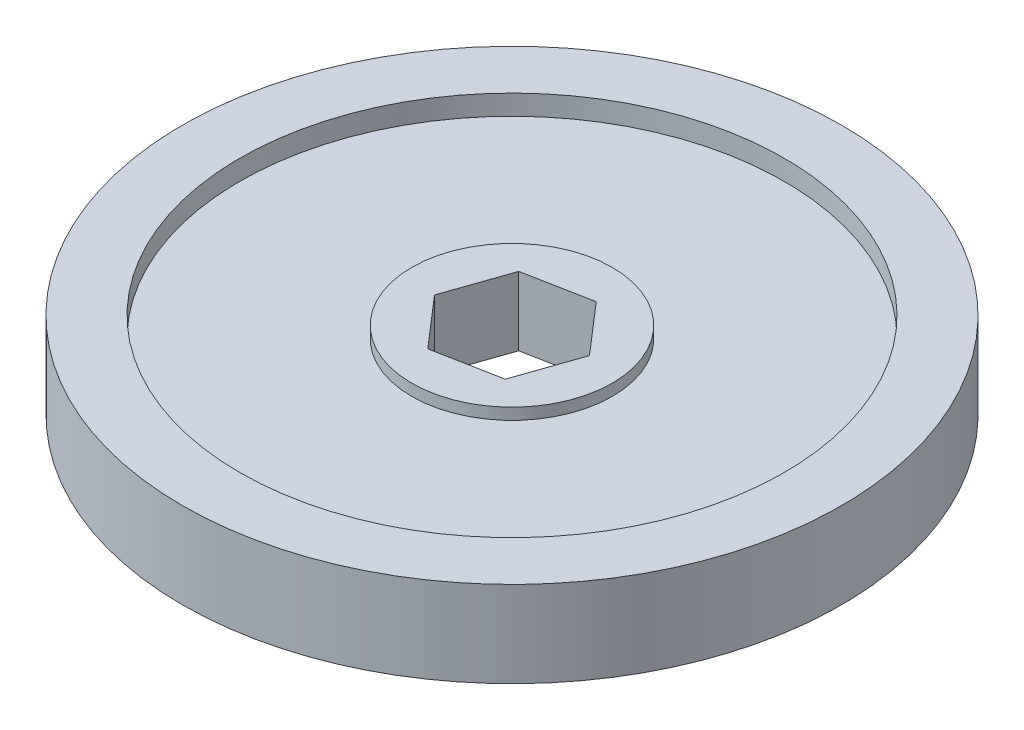
ISO-10303-21;
HEADER;
FILE_DESCRIPTION(('STEP AP214'),'2;1');
FILE_NAME('part.step','',(''),(''),'','','');
FILE_SCHEMA(('AUTOMOTIVE_DESIGN { 1 0 10303 214 1 1 1 1 }'));
ENDSEC;
DATA;
#1=APPLICATION_CONTEXT('core data for automotive mechanical design processes');
#2=APPLICATION_PROTOCOL_DEFINITION('international standard','automotive_design',2000,#1);
#3=PRODUCT_CONTEXT('',#1,'mechanical');
#4=PRODUCT('Part','Part','',(#3));
#5=PRODUCT_RELATED_PRODUCT_CATEGORY('part','',(#4));
#6=PRODUCT_DEFINITION_FORMATION('','',#4);
#7=PRODUCT_DEFINITION_CONTEXT('part definition',#1,'design');
#8=PRODUCT_DEFINITION('design','',#6,#7);
#9=PRODUCT_DEFINITION_SHAPE('','',#8);
#10=(LENGTH_UNIT() NAMED_UNIT(*) SI_UNIT(.MILLI.,.METRE.));
#11=(NAMED_UNIT(*) PLANE_ANGLE_UNIT() SI_UNIT($,.RADIAN.));
#12=(NAMED_UNIT(*) SI_UNIT($,.STERADIAN.) SOLID_ANGLE_UNIT());
#13=UNCERTAINTY_MEASURE_WITH_UNIT(LENGTH_MEASURE(1.E-05),#10,'distance_accuracy_value','');
#14=(GEOMETRIC_REPRESENTATION_CONTEXT(3) GLOBAL_UNCERTAINTY_ASSIGNED_CONTEXT((#13)) GLOBAL_UNIT_ASSIGNED_CONTEXT((#10,
#11,#12)) REPRESENTATION_CONTEXT('',''));
#15=CARTESIAN_POINT('',(0.,0.,0.));
#16=DIRECTION('',(0.,0.,1.));
#17=DIRECTION('',(1.,0.,0.));
#18=AXIS2_PLACEMENT_3D('',#15,#16,#17);
#19=CARTESIAN_POINT('',(0.,2.2225,0.));
#20=DIRECTION('',(0.,1.,0.));
#21=DIRECTION('',(0.,0.,1.));
#22=AXIS2_PLACEMENT_3D('',#19,#20,#21);
#23=PLANE('',#22);
#24=CARTESIAN_POINT('',(0.,2.2225,0.));
#25=DIRECTION('',(0.,1.,0.));
#26=DIRECTION('',(0.,0.,1.));
#27=AXIS2_PLACEMENT_3D('',#24,#25,#26);
#28=CIRCLE('',#27,30.1625);
#29=CARTESIAN_POINT('',(0.,2.2225,30.1625));
#30=VERTEX_POINT('',#29);
#31=EDGE_CURVE('E171',#30,#30,#28,.T.);
#32=ORIENTED_EDGE('',*,*,#31,.F.);
#33=EDGE_LOOP('',(#32));
#34=FACE_BOUND('',#33,.T.);
#35=CARTESIAN_POINT('',(0.,2.2225,0.));
#36=DIRECTION('',(0.,1.,0.));
#37=DIRECTION('',(0.,0.,1.));
#38=AXIS2_PLACEMENT_3D('',#35,#36,#37);
#39=CIRCLE('',#38,11.1125);
#40=CARTESIAN_POINT('',(0.,2.2225,11.1125));
#41=VERTEX_POINT('',#40);
#42=EDGE_CURVE('E47',#41,#41,#39,.F.);
#43=ORIENTED_EDGE('',*,*,#42,.F.);
#44=EDGE_LOOP('',(#43));
#45=FACE_BOUND('',#44,.T.);
#46=ADVANCED_FACE('F38',(#34,#45),#23,.F.);
#47=CARTESIAN_POINT('',(0.,9.525,0.));
#48=DIRECTION('',(0.,-1.,0.));
#49=DIRECTION('',(0.,0.,-1.));
#50=AXIS2_PLACEMENT_3D('',#47,#48,#49);
#51=CYLINDRICAL_SURFACE('',#50,30.1625);
#52=CARTESIAN_POINT('',(0.,0.,0.));
#53=DIRECTION('',(0.,1.,0.));
#54=DIRECTION('',(0.,0.,1.));
#55=AXIS2_PLACEMENT_3D('',#52,#53,#54);
#56=CIRCLE('',#55,30.1625);
#57=CARTESIAN_POINT('',(0.,0.,30.1625));
#58=VERTEX_POINT('',#57);
#59=EDGE_CURVE('E185',#58,#58,#56,.T.);
#60=ORIENTED_EDGE('',*,*,#59,.F.);
#61=EDGE_LOOP('',(#60));
#62=FACE_BOUND('',#61,.T.);
#63=ORIENTED_EDGE('',*,*,#31,.T.);
#64=EDGE_LOOP('',(#63));
#65=FACE_BOUND('',#64,.T.);
#66=ADVANCED_FACE('F211',(#62,#65),#51,.F.);
#67=CARTESIAN_POINT('',(0.,9.525,0.));
#68=DIRECTION('',(0.,1.,0.));
#69=DIRECTION('',(0.,0.,1.));
#70=AXIS2_PLACEMENT_3D('',#67,#68,#69);
#71=PLANE('',#70);
#72=CARTESIAN_POINT('',(0.,9.525,0.));
#73=DIRECTION('',(0.,1.,0.));
#74=DIRECTION('',(0.,0.,1.));
#75=AXIS2_PLACEMENT_3D('',#72,#73,#74);
#76=CIRCLE('',#75,36.5125);
#77=CARTESIAN_POINT('',(0.,9.525,36.5125));
#78=VERTEX_POINT('',#77);
#79=EDGE_CURVE('E194',#78,#78,#76,.T.);
#80=ORIENTED_EDGE('',*,*,#79,.T.);
#81=EDGE_LOOP('',(#80));
#82=FACE_BOUND('',#81,.T.);
#83=CARTESIAN_POINT('',(0.,9.525,0.));
#84=DIRECTION('',(0.,1.,0.));
#85=DIRECTION('',(0.,0.,1.));
#86=AXIS2_PLACEMENT_3D('',#83,#84,#85);
#87=CIRCLE('',#86,30.1625);
#88=CARTESIAN_POINT('',(0.,9.525,30.1625));
#89=VERTEX_POINT('',#88);
#90=EDGE_CURVE('E186',#89,#89,#87,.T.);
#91=ORIENTED_EDGE('',*,*,#90,.F.);
#92=EDGE_LOOP('',(#91));
#93=FACE_BOUND('',#92,.T.);
#94=ADVANCED_FACE('F217',(#82,#93),#71,.T.);
#95=CARTESIAN_POINT('',(0.,0.,0.));
#96=DIRECTION('',(0.,1.,0.));
#97=DIRECTION('',(0.,0.,1.));
#98=AXIS2_PLACEMENT_3D('',#95,#96,#97);
#99=PLANE('',#98);
#100=CARTESIAN_POINT('',(0.,0.,0.));
#101=DIRECTION('',(0.,1.,0.));
#102=DIRECTION('',(0.,0.,1.));
#103=AXIS2_PLACEMENT_3D('',#100,#101,#102);
#104=CIRCLE('',#103,36.5125);
#105=CARTESIAN_POINT('',(0.,0.,36.5125));
#106=VERTEX_POINT('',#105);
#107=EDGE_CURVE('E190',#106,#106,#104,.T.);
#108=ORIENTED_EDGE('',*,*,#107,.F.);
#109=EDGE_LOOP('',(#108));
#110=FACE_BOUND('',#109,.T.);
#111=ORIENTED_EDGE('',*,*,#59,.T.);
#112=EDGE_LOOP('',(#111));
#113=FACE_BOUND('',#112,.T.);
#114=ADVANCED_FACE('F229',(#110,#113),#99,.F.);
#115=CARTESIAN_POINT('',(0.,9.525,0.));
#116=DIRECTION('',(0.,-1.,0.));
#117=DIRECTION('',(0.,0.,-1.));
#118=AXIS2_PLACEMENT_3D('',#115,#116,#117);
#119=CYLINDRICAL_SURFACE('',#118,36.5125);
#120=ORIENTED_EDGE('',*,*,#79,.F.);
#121=EDGE_LOOP('',(#120));
#122=FACE_BOUND('',#121,.T.);
#123=ORIENTED_EDGE('',*,*,#107,.T.);
#124=EDGE_LOOP('',(#123));
#125=FACE_BOUND('',#124,.T.);
#126=ADVANCED_FACE('F40',(#122,#125),#119,.T.);
#127=CARTESIAN_POINT('',(0.,7.3025,0.));
#128=DIRECTION('',(0.,1.,0.));
#129=DIRECTION('',(0.,0.,1.));
#130=AXIS2_PLACEMENT_3D('',#127,#128,#129);
#131=CIRCLE('',#130,30.1625);
#132=CARTESIAN_POINT('',(0.,7.3025,30.1625));
#133=VERTEX_POINT('',#132);
#134=EDGE_CURVE('E198',#133,#133,#131,.T.);
#135=ORIENTED_EDGE('',*,*,#134,.F.);
#136=EDGE_LOOP('',(#135));
#137=FACE_BOUND('',#136,.T.);
#138=ORIENTED_EDGE('',*,*,#90,.T.);
#139=EDGE_LOOP('',(#138));
#140=FACE_BOUND('',#139,.T.);
#141=ADVANCED_FACE('F220',(#137,#140),#51,.F.);
#142=CARTESIAN_POINT('',(4.79799632688245,2.2225,5.54459778347858));
#143=DIRECTION('',(0.944784017683705,0.,0.327693698336476));
#144=DIRECTION('',(0.327693698336476,0.,-0.944784017683705));
#145=AXIS2_PLACEMENT_3D('',#142,#143,#144);
#146=PLANE('',#145);
#147=DIRECTION('',(0.,1.,0.));
#148=VECTOR('',#147,1.);
#149=CARTESIAN_POINT('',(4.79799632688245,2.2225,5.54459778347858));
#150=LINE('',#149,#148);
#151=CARTESIAN_POINT('',(4.79799632688245,0.9525,5.54459778347858));
#152=VERTEX_POINT('',#151);
#153=CARTESIAN_POINT('',(4.79799632688245,8.5725,5.54459778347858));
#154=VERTEX_POINT('',#153);
#155=EDGE_CURVE('E56',#152,#154,#150,.T.);
#156=ORIENTED_EDGE('',*,*,#155,.T.);
#157=DIRECTION('',(-0.327693698336476,0.,0.944784017683705));
#158=VECTOR('',#157,1.);
#159=CARTESIAN_POINT('',(7.20076069770056,8.5725,-1.38288781460534));
#160=LINE('',#159,#158);
#161=CARTESIAN_POINT('',(7.20076069770056,8.5725,-1.38288781460534));
#162=VERTEX_POINT('',#161);
#163=EDGE_CURVE('E124',#162,#154,#160,.T.);
#164=ORIENTED_EDGE('',*,*,#163,.F.);
#165=DIRECTION('',(0.,1.,0.));
#166=VECTOR('',#165,1.);
#167=CARTESIAN_POINT('',(7.20076069770056,2.2225,-1.38288781460534));
#168=LINE('',#167,#166);
#169=CARTESIAN_POINT('',(7.20076069770056,0.9525,-1.38288781460534));
#170=VERTEX_POINT('',#169);
#171=EDGE_CURVE('E169',#170,#162,#168,.T.);
#172=ORIENTED_EDGE('',*,*,#171,.F.);
#173=DIRECTION('',(-0.327693698336476,0.,0.944784017683705));
#174=VECTOR('',#173,1.);
#175=CARTESIAN_POINT('',(7.20076069770056,0.9525,-1.38288781460534));
#176=LINE('',#175,#174);
#177=EDGE_CURVE('E160',#170,#152,#176,.T.);
#178=ORIENTED_EDGE('',*,*,#177,.T.);
#179=EDGE_LOOP('',(#156,#164,#172,#178));
#180=FACE_BOUND('',#179,.T.);
#181=ADVANCED_FACE('F223',(#180),#146,.F.);
#182=CARTESIAN_POINT('',(-2.40276437081811,2.2225,6.92748559808392));
#183=DIRECTION('',(0.18860094142239,0.,0.982053809571853));
#184=DIRECTION('',(0.982053809571853,0.,-0.18860094142239));
#185=AXIS2_PLACEMENT_3D('',#182,#183,#184);
#186=PLANE('',#185);
#187=DIRECTION('',(0.,1.,0.));
#188=VECTOR('',#187,1.);
#189=CARTESIAN_POINT('',(-2.40276437081811,2.2225,6.92748559808392));
#190=LINE('',#189,#188);
#191=CARTESIAN_POINT('',(-2.40276437081811,0.9525,6.92748559808392));
#192=VERTEX_POINT('',#191);
#193=CARTESIAN_POINT('',(-2.40276437081811,8.5725,6.92748559808392));
#194=VERTEX_POINT('',#193);
#195=EDGE_CURVE('E67',#192,#194,#190,.T.);
#196=ORIENTED_EDGE('',*,*,#195,.T.);
#197=DIRECTION('',(-0.982053809571853,0.,0.18860094142239));
#198=VECTOR('',#197,1.);
#199=CARTESIAN_POINT('',(4.79799632688245,8.5725,5.54459778347858));
#200=LINE('',#199,#198);
#201=EDGE_CURVE('E104',#154,#194,#200,.T.);
#202=ORIENTED_EDGE('',*,*,#201,.F.);
#203=ORIENTED_EDGE('',*,*,#155,.F.);
#204=DIRECTION('',(-0.982053809571853,0.,0.18860094142239));
#205=VECTOR('',#204,1.);
#206=CARTESIAN_POINT('',(4.79799632688245,0.9525,5.54459778347858));
#207=LINE('',#206,#205);
#208=EDGE_CURVE('E107',#152,#192,#207,.T.);
#209=ORIENTED_EDGE('',*,*,#208,.T.);
#210=EDGE_LOOP('',(#196,#202,#203,#209));
#211=FACE_BOUND('',#210,.T.);
#212=ADVANCED_FACE('F102',(#211),#186,.F.);
#213=CARTESIAN_POINT('',(-7.20076069770056,2.2225,1.38288781460534));
#214=DIRECTION('',(-0.756183076261315,0.,0.654360111235377));
#215=DIRECTION('',(0.654360111235377,0.,0.756183076261315));
#216=AXIS2_PLACEMENT_3D('',#213,#214,#215);
#217=PLANE('',#216);
#218=DIRECTION('',(0.,1.,0.));
#219=VECTOR('',#218,1.);
#220=CARTESIAN_POINT('',(-7.20076069770056,2.2225,1.38288781460534));
#221=LINE('',#220,#219);
#222=CARTESIAN_POINT('',(-7.20076069770056,0.9525,1.38288781460534));
#223=VERTEX_POINT('',#222);
#224=CARTESIAN_POINT('',(-7.20076069770056,8.5725,1.38288781460534));
#225=VERTEX_POINT('',#224);
#226=EDGE_CURVE('E110',#223,#225,#221,.T.);
#227=ORIENTED_EDGE('',*,*,#226,.T.);
#228=DIRECTION('',(-0.654360111235377,0.,-0.756183076261315));
#229=VECTOR('',#228,1.);
#230=CARTESIAN_POINT('',(-2.40276437081811,8.5725,6.92748559808392));
#231=LINE('',#230,#229);
#232=EDGE_CURVE('E113',#194,#225,#231,.T.);
#233=ORIENTED_EDGE('',*,*,#232,.F.);
#234=ORIENTED_EDGE('',*,*,#195,.F.);
#235=DIRECTION('',(-0.654360111235377,0.,-0.756183076261315));
#236=VECTOR('',#235,1.);
#237=CARTESIAN_POINT('',(-2.40276437081811,0.9525,6.92748559808392));
#238=LINE('',#237,#236);
#239=EDGE_CURVE('E145',#192,#223,#238,.T.);
#240=ORIENTED_EDGE('',*,*,#239,.T.);
#241=EDGE_LOOP('',(#227,#233,#234,#240));
#242=FACE_BOUND('',#241,.T.);
#243=ADVANCED_FACE('F114',(#242),#217,.F.);
#244=CARTESIAN_POINT('',(-4.79799632688245,2.2225,-5.54459778347857));
#245=DIRECTION('',(-0.944784017683705,0.,-0.327693698336476));
#246=DIRECTION('',(-0.327693698336476,0.,0.944784017683705));
#247=AXIS2_PLACEMENT_3D('',#244,#245,#246);
#248=PLANE('',#247);
#249=DIRECTION('',(0.,1.,0.));
#250=VECTOR('',#249,1.);
#251=CARTESIAN_POINT('',(-4.79799632688245,2.2225,-5.54459778347857));
#252=LINE('',#251,#250);
#253=CARTESIAN_POINT('',(-4.79799632688245,0.9525,-5.54459778347857));
#254=VERTEX_POINT('',#253);
#255=CARTESIAN_POINT('',(-4.79799632688245,8.5725,-5.54459778347857));
#256=VERTEX_POINT('',#255);
#257=EDGE_CURVE('E174',#254,#256,#252,.T.);
#258=ORIENTED_EDGE('',*,*,#257,.T.);
#259=DIRECTION('',(0.327693698336476,0.,-0.944784017683705));
#260=VECTOR('',#259,1.);
#261=CARTESIAN_POINT('',(-7.20076069770056,8.5725,1.38288781460534));
#262=LINE('',#261,#260);
#263=EDGE_CURVE('E138',#225,#256,#262,.T.);
#264=ORIENTED_EDGE('',*,*,#263,.F.);
#265=ORIENTED_EDGE('',*,*,#226,.F.);
#266=DIRECTION('',(0.327693698336476,0.,-0.944784017683705));
#267=VECTOR('',#266,1.);
#268=CARTESIAN_POINT('',(-7.20076069770056,0.9525,1.38288781460534));
#269=LINE('',#268,#267);
#270=EDGE_CURVE('E148',#223,#254,#269,.T.);
#271=ORIENTED_EDGE('',*,*,#270,.T.);
#272=EDGE_LOOP('',(#258,#264,#265,#271));
#273=FACE_BOUND('',#272,.T.);
#274=ADVANCED_FACE('F271',(#273),#248,.F.);
#275=CARTESIAN_POINT('',(2.40276437081811,2.2225,-6.92748559808392));
#276=DIRECTION('',(-0.18860094142239,0.,-0.982053809571853));
#277=DIRECTION('',(-0.982053809571853,0.,0.18860094142239));
#278=AXIS2_PLACEMENT_3D('',#275,#276,#277);
#279=PLANE('',#278);
#280=DIRECTION('',(0.,1.,0.));
#281=VECTOR('',#280,1.);
#282=CARTESIAN_POINT('',(2.40276437081811,2.2225,-6.92748559808392));
#283=LINE('',#282,#281);
#284=CARTESIAN_POINT('',(2.40276437081811,0.9525,-6.92748559808391));
#285=VERTEX_POINT('',#284);
#286=CARTESIAN_POINT('',(2.40276437081811,8.5725,-6.92748559808391));
#287=VERTEX_POINT('',#286);
#288=EDGE_CURVE('E177',#285,#287,#283,.T.);
#289=ORIENTED_EDGE('',*,*,#288,.T.);
#290=DIRECTION('',(0.982053809571852,0.,-0.188600941422389));
#291=VECTOR('',#290,1.);
#292=CARTESIAN_POINT('',(-4.79799632688245,8.5725,-5.54459778347857));
#293=LINE('',#292,#291);
#294=EDGE_CURVE('E134',#256,#287,#293,.T.);
#295=ORIENTED_EDGE('',*,*,#294,.F.);
#296=ORIENTED_EDGE('',*,*,#257,.F.);
#297=DIRECTION('',(0.982053809571852,0.,-0.188600941422389));
#298=VECTOR('',#297,1.);
#299=CARTESIAN_POINT('',(-4.79799632688245,0.9525,-5.54459778347857));
#300=LINE('',#299,#298);
#301=EDGE_CURVE('E152',#254,#285,#300,.T.);
#302=ORIENTED_EDGE('',*,*,#301,.T.);
#303=EDGE_LOOP('',(#289,#295,#296,#302));
#304=FACE_BOUND('',#303,.T.);
#305=ADVANCED_FACE('F278',(#304),#279,.F.);
#306=CARTESIAN_POINT('',(7.20076069770056,2.2225,-1.38288781460534));
#307=DIRECTION('',(0.756183076261315,0.,-0.654360111235377));
#308=DIRECTION('',(-0.654360111235377,0.,-0.756183076261315));
#309=AXIS2_PLACEMENT_3D('',#306,#307,#308);
#310=PLANE('',#309);
#311=ORIENTED_EDGE('',*,*,#171,.T.);
#312=DIRECTION('',(0.654360111235377,0.,0.756183076261315));
#313=VECTOR('',#312,1.);
#314=CARTESIAN_POINT('',(2.40276437081811,8.5725,-6.92748559808391));
#315=LINE('',#314,#313);
#316=EDGE_CURVE('E129',#287,#162,#315,.T.);
#317=ORIENTED_EDGE('',*,*,#316,.F.);
#318=ORIENTED_EDGE('',*,*,#288,.F.);
#319=DIRECTION('',(0.654360111235377,0.,0.756183076261315));
#320=VECTOR('',#319,1.);
#321=CARTESIAN_POINT('',(2.40276437081811,0.9525,-6.92748559808391));
#322=LINE('',#321,#320);
#323=EDGE_CURVE('E156',#285,#170,#322,.T.);
#324=ORIENTED_EDGE('',*,*,#323,.T.);
#325=EDGE_LOOP('',(#311,#317,#318,#324));
#326=FACE_BOUND('',#325,.T.);
#327=ADVANCED_FACE('F287',(#326),#310,.F.);
#328=CARTESIAN_POINT('',(0.,7.3025,0.));
#329=DIRECTION('',(0.,1.,0.));
#330=DIRECTION('',(0.,0.,1.));
#331=AXIS2_PLACEMENT_3D('',#328,#329,#330);
#332=PLANE('',#331);
#333=CARTESIAN_POINT('',(0.,7.3025,0.));
#334=DIRECTION('',(0.,1.,0.));
#335=DIRECTION('',(0.,0.,1.));
#336=AXIS2_PLACEMENT_3D('',#333,#334,#335);
#337=CIRCLE('',#336,11.1125);
#338=CARTESIAN_POINT('',(0.,7.3025,11.1125));
#339=VERTEX_POINT('',#338);
#340=EDGE_CURVE('E11',#339,#339,#337,.T.);
#341=ORIENTED_EDGE('',*,*,#340,.F.);
#342=EDGE_LOOP('',(#341));
#343=FACE_BOUND('',#342,.T.);
#344=ORIENTED_EDGE('',*,*,#134,.T.);
#345=EDGE_LOOP('',(#344));
#346=FACE_BOUND('',#345,.T.);
#347=ADVANCED_FACE('F294',(#343,#346),#332,.T.);
#348=CARTESIAN_POINT('',(0.,0.9525,0.));
#349=DIRECTION('',(0.,-1.,0.));
#350=DIRECTION('',(0.,0.,-1.));
#351=AXIS2_PLACEMENT_3D('',#348,#349,#350);
#352=PLANE('',#351);
#353=CARTESIAN_POINT('',(0.,0.9525,0.));
#354=DIRECTION('',(0.,-1.,0.));
#355=DIRECTION('',(0.,0.,-1.));
#356=AXIS2_PLACEMENT_3D('',#353,#354,#355);
#357=CIRCLE('',#356,11.1125);
#358=CARTESIAN_POINT('',(0.,0.9525,-11.1125));
#359=VERTEX_POINT('',#358);
#360=EDGE_CURVE('E165',#359,#359,#357,.T.);
#361=ORIENTED_EDGE('',*,*,#360,.T.);
#362=EDGE_LOOP('',(#361));
#363=FACE_BOUND('',#362,.T.);
#364=ORIENTED_EDGE('',*,*,#270,.F.);
#365=ORIENTED_EDGE('',*,*,#239,.F.);
#366=ORIENTED_EDGE('',*,*,#208,.F.);
#367=ORIENTED_EDGE('',*,*,#177,.F.);
#368=ORIENTED_EDGE('',*,*,#323,.F.);
#369=ORIENTED_EDGE('',*,*,#301,.F.);
#370=EDGE_LOOP('',(#364,#365,#366,#367,#368,#369));
#371=FACE_BOUND('',#370,.T.);
#372=ADVANCED_FACE('F302',(#363,#371),#352,.T.);
#373=CARTESIAN_POINT('',(0.,0.9525,0.));
#374=DIRECTION('',(0.,1.,0.));
#375=DIRECTION('',(0.,0.,1.));
#376=AXIS2_PLACEMENT_3D('',#373,#374,#375);
#377=CYLINDRICAL_SURFACE('',#376,11.1125);
#378=ORIENTED_EDGE('',*,*,#360,.F.);
#379=EDGE_LOOP('',(#378));
#380=FACE_BOUND('',#379,.T.);
#381=ORIENTED_EDGE('',*,*,#42,.T.);
#382=EDGE_LOOP('',(#381));
#383=FACE_BOUND('',#382,.T.);
#384=ADVANCED_FACE('F208',(#380,#383),#377,.T.);
#385=CARTESIAN_POINT('',(0.,8.5725,0.));
#386=DIRECTION('',(0.,-1.,0.));
#387=DIRECTION('',(0.,0.,-1.));
#388=AXIS2_PLACEMENT_3D('',#385,#386,#387);
#389=CYLINDRICAL_SURFACE('',#388,11.1125);
#390=CARTESIAN_POINT('',(0.,8.5725,0.));
#391=DIRECTION('',(0.,-1.,0.));
#392=DIRECTION('',(0.,0.,-1.));
#393=AXIS2_PLACEMENT_3D('',#390,#391,#392);
#394=CIRCLE('',#393,11.1125);
#395=CARTESIAN_POINT('',(0.,8.5725,-11.1125));
#396=VERTEX_POINT('',#395);
#397=EDGE_CURVE('E141',#396,#396,#394,.T.);
#398=ORIENTED_EDGE('',*,*,#397,.T.);
#399=EDGE_LOOP('',(#398));
#400=FACE_BOUND('',#399,.T.);
#401=ORIENTED_EDGE('',*,*,#340,.T.);
#402=EDGE_LOOP('',(#401));
#403=FACE_BOUND('',#402,.T.);
#404=ADVANCED_FACE('F315',(#400,#403),#389,.T.);
#405=CARTESIAN_POINT('',(0.,8.5725,0.));
#406=DIRECTION('',(0.,1.,0.));
#407=DIRECTION('',(0.,0.,-1.));
#408=AXIS2_PLACEMENT_3D('',#405,#406,#407);
#409=PLANE('',#408);
#410=ORIENTED_EDGE('',*,*,#232,.T.);
#411=ORIENTED_EDGE('',*,*,#263,.T.);
#412=ORIENTED_EDGE('',*,*,#294,.T.);
#413=ORIENTED_EDGE('',*,*,#316,.T.);
#414=ORIENTED_EDGE('',*,*,#163,.T.);
#415=ORIENTED_EDGE('',*,*,#201,.T.);
#416=EDGE_LOOP('',(#410,#411,#412,#413,#414,#415));
#417=FACE_BOUND('',#416,.T.);
#418=ORIENTED_EDGE('',*,*,#397,.F.);
#419=EDGE_LOOP('',(#418));
#420=FACE_BOUND('',#419,.T.);
#421=ADVANCED_FACE('F120',(#417,#420),#409,.T.);
#422=CLOSED_SHELL('',(#46,#66,#94,#114,#126,#141,#181,#212,#243,#274,#305,#327,#347,#372,#384,
#404,#421));
#423=MANIFOLD_SOLID_BREP('B2',#422);
#424=ADVANCED_BREP_SHAPE_REPRESENTATION('',(#18,#423),#14);
#425=SHAPE_DEFINITION_REPRESENTATION(#9,#424);
ENDSEC;
END-ISO-10303-21;
